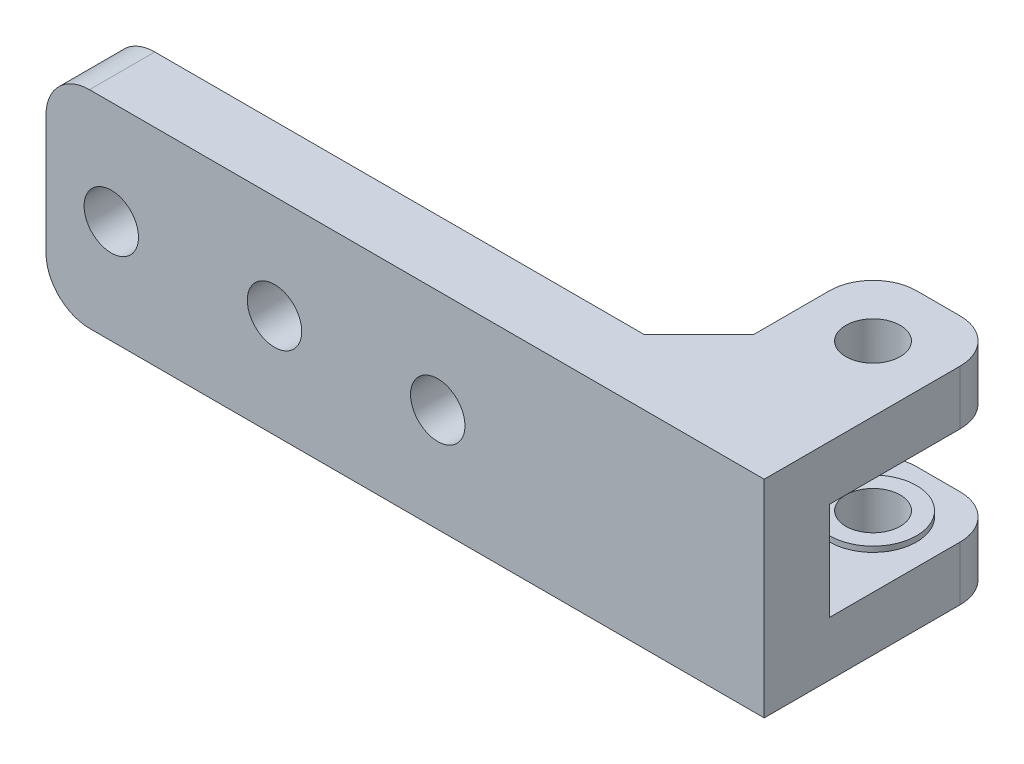
ISO-10303-21;
HEADER;
FILE_DESCRIPTION(('STEP AP214'),'2;1');
FILE_NAME('part.step','',(''),(''),'','','');
FILE_SCHEMA(('AUTOMOTIVE_DESIGN { 1 0 10303 214 1 1 1 1 }'));
ENDSEC;
DATA;
#1=APPLICATION_CONTEXT('core data for automotive mechanical design processes');
#2=APPLICATION_PROTOCOL_DEFINITION('international standard','automotive_design',2000,#1);
#3=PRODUCT_CONTEXT('',#1,'mechanical');
#4=PRODUCT('Part','Part','',(#3));
#5=PRODUCT_RELATED_PRODUCT_CATEGORY('part','',(#4));
#6=PRODUCT_DEFINITION_FORMATION('','',#4);
#7=PRODUCT_DEFINITION_CONTEXT('part definition',#1,'design');
#8=PRODUCT_DEFINITION('design','',#6,#7);
#9=PRODUCT_DEFINITION_SHAPE('','',#8);
#10=(LENGTH_UNIT() NAMED_UNIT(*) SI_UNIT(.MILLI.,.METRE.));
#11=(NAMED_UNIT(*) PLANE_ANGLE_UNIT() SI_UNIT($,.RADIAN.));
#12=(NAMED_UNIT(*) SI_UNIT($,.STERADIAN.) SOLID_ANGLE_UNIT());
#13=UNCERTAINTY_MEASURE_WITH_UNIT(LENGTH_MEASURE(1.E-05),#10,'distance_accuracy_value','');
#14=(GEOMETRIC_REPRESENTATION_CONTEXT(3) GLOBAL_UNCERTAINTY_ASSIGNED_CONTEXT((#13)) GLOBAL_UNIT_ASSIGNED_CONTEXT((#10,
#11,#12)) REPRESENTATION_CONTEXT('',''));
#15=CARTESIAN_POINT('',(0.,0.,0.));
#16=DIRECTION('',(0.,0.,1.));
#17=DIRECTION('',(1.,0.,0.));
#18=AXIS2_PLACEMENT_3D('',#15,#16,#17);
#19=CARTESIAN_POINT('',(0.,0.,0.));
#20=DIRECTION('',(1.,0.,0.));
#21=DIRECTION('',(0.,0.,-1.));
#22=AXIS2_PLACEMENT_3D('',#19,#20,#21);
#23=PLANE('',#22);
#24=DIRECTION('',(0.,0.,-1.));
#25=VECTOR('',#24,1.);
#26=CARTESIAN_POINT('',(0.,0.,0.));
#27=LINE('',#26,#25);
#28=CARTESIAN_POINT('',(0.,0.,-11.));
#29=VERTEX_POINT('',#28);
#30=CARTESIAN_POINT('',(0.,0.,-18.));
#31=VERTEX_POINT('',#30);
#32=EDGE_CURVE('E360',#29,#31,#27,.T.);
#33=ORIENTED_EDGE('',*,*,#32,.F.);
#34=DIRECTION('',(0.,1.,0.));
#35=VECTOR('',#34,1.);
#36=CARTESIAN_POINT('',(0.,5.,-11.));
#37=LINE('',#36,#35);
#38=CARTESIAN_POINT('',(0.,5.,-11.));
#39=VERTEX_POINT('',#38);
#40=EDGE_CURVE('E238',#29,#39,#37,.T.);
#41=ORIENTED_EDGE('',*,*,#40,.T.);
#42=DIRECTION('',(0.,0.,1.));
#43=VECTOR('',#42,1.);
#44=CARTESIAN_POINT('',(0.,5.,-22.));
#45=LINE('',#44,#43);
#46=CARTESIAN_POINT('',(0.,5.,-18.));
#47=VERTEX_POINT('',#46);
#48=EDGE_CURVE('E326',#47,#39,#45,.T.);
#49=ORIENTED_EDGE('',*,*,#48,.F.);
#50=DIRECTION('',(0.,1.,0.));
#51=VECTOR('',#50,1.);
#52=CARTESIAN_POINT('',(0.,0.,-18.));
#53=LINE('',#52,#51);
#54=EDGE_CURVE('E212',#47,#31,#53,.F.);
#55=ORIENTED_EDGE('',*,*,#54,.T.);
#56=EDGE_LOOP('',(#33,#41,#49,#55));
#57=FACE_BOUND('',#56,.T.);
#58=ADVANCED_FACE('F37',(#57),#23,.F.);
#59=CARTESIAN_POINT('',(12.,5.,-22.));
#60=DIRECTION('',(0.,-1.,0.));
#61=DIRECTION('',(0.,0.,-1.));
#62=AXIS2_PLACEMENT_3D('',#59,#60,#61);
#63=PLANE('',#62);
#64=DIRECTION('',(-1.,0.,0.));
#65=VECTOR('',#64,1.);
#66=CARTESIAN_POINT('',(12.,5.,-22.));
#67=LINE('',#66,#65);
#68=CARTESIAN_POINT('',(8.,5.,-22.));
#69=VERTEX_POINT('',#68);
#70=CARTESIAN_POINT('',(4.,5.,-22.));
#71=VERTEX_POINT('',#70);
#72=EDGE_CURVE('E197',#69,#71,#67,.T.);
#73=ORIENTED_EDGE('',*,*,#72,.T.);
#74=CARTESIAN_POINT('',(4.,5.,-18.));
#75=DIRECTION('',(0.,-1.,0.));
#76=DIRECTION('',(0.,0.,-1.));
#77=AXIS2_PLACEMENT_3D('',#74,#75,#76);
#78=CIRCLE('',#77,4.);
#79=EDGE_CURVE('E229',#71,#47,#78,.F.);
#80=ORIENTED_EDGE('',*,*,#79,.T.);
#81=ORIENTED_EDGE('',*,*,#48,.T.);
#82=DIRECTION('',(0.707106781186544,0.,-0.707106781186551));
#83=VECTOR('',#82,1.);
#84=CARTESIAN_POINT('',(11.4999999999999,5.,-22.5000000000001));
#85=LINE('',#84,#83);
#86=CARTESIAN_POINT('',(-4.99999999999998,5.,-6.));
#87=VERTEX_POINT('',#86);
#88=EDGE_CURVE('E250',#39,#87,#85,.F.);
#89=ORIENTED_EDGE('',*,*,#88,.T.);
#90=DIRECTION('',(-1.,0.,0.));
#91=VECTOR('',#90,1.);
#92=CARTESIAN_POINT('',(12.,5.,-6.));
#93=LINE('',#92,#91);
#94=CARTESIAN_POINT('',(12.,5.,-6.));
#95=VERTEX_POINT('',#94);
#96=EDGE_CURVE('E384',#95,#87,#93,.T.);
#97=ORIENTED_EDGE('',*,*,#96,.F.);
#98=DIRECTION('',(0.,0.,1.));
#99=VECTOR('',#98,1.);
#100=CARTESIAN_POINT('',(12.,5.,-22.));
#101=LINE('',#100,#99);
#102=CARTESIAN_POINT('',(12.,5.,-18.));
#103=VERTEX_POINT('',#102);
#104=EDGE_CURVE('E174',#103,#95,#101,.T.);
#105=ORIENTED_EDGE('',*,*,#104,.F.);
#106=CARTESIAN_POINT('',(8.,5.,-18.));
#107=DIRECTION('',(0.,-1.,0.));
#108=DIRECTION('',(0.,0.,-1.));
#109=AXIS2_PLACEMENT_3D('',#106,#107,#108);
#110=CIRCLE('',#109,4.);
#111=EDGE_CURVE('E227',#103,#69,#110,.F.);
#112=ORIENTED_EDGE('',*,*,#111,.T.);
#113=EDGE_LOOP('',(#73,#80,#81,#89,#97,#105,#112));
#114=FACE_BOUND('',#113,.T.);
#115=CARTESIAN_POINT('',(6.,5.,-16.));
#116=DIRECTION('',(0.,-1.,0.));
#117=DIRECTION('',(0.,0.,-1.));
#118=AXIS2_PLACEMENT_3D('',#115,#116,#117);
#119=CIRCLE('',#118,4.);
#120=CARTESIAN_POINT('',(6.,5.,-20.));
#121=VERTEX_POINT('',#120);
#122=EDGE_CURVE('E194',#121,#121,#119,.F.);
#123=ORIENTED_EDGE('',*,*,#122,.F.);
#124=EDGE_LOOP('',(#123));
#125=FACE_BOUND('',#124,.T.);
#126=ADVANCED_FACE('F294',(#114,#125),#63,.F.);
#127=CARTESIAN_POINT('',(12.,14.,-6.));
#128=DIRECTION('',(0.,1.,0.));
#129=DIRECTION('',(0.,0.,1.));
#130=AXIS2_PLACEMENT_3D('',#127,#128,#129);
#131=PLANE('',#130);
#132=DIRECTION('',(-1.,0.,0.));
#133=VECTOR('',#132,1.);
#134=CARTESIAN_POINT('',(12.,14.,-6.));
#135=LINE('',#134,#133);
#136=CARTESIAN_POINT('',(12.,14.,-6.));
#137=VERTEX_POINT('',#136);
#138=CARTESIAN_POINT('',(-4.99999999999998,14.,-6.));
#139=VERTEX_POINT('',#138);
#140=EDGE_CURVE('E382',#137,#139,#135,.T.);
#141=ORIENTED_EDGE('',*,*,#140,.T.);
#142=DIRECTION('',(-0.707106781186544,0.,0.707106781186551));
#143=VECTOR('',#142,1.);
#144=CARTESIAN_POINT('',(3.49999999999992,14.,-14.5));
#145=LINE('',#144,#143);
#146=CARTESIAN_POINT('',(0.,14.,-11.));
#147=VERTEX_POINT('',#146);
#148=EDGE_CURVE('E257',#139,#147,#145,.F.);
#149=ORIENTED_EDGE('',*,*,#148,.T.);
#150=DIRECTION('',(0.,0.,-1.));
#151=VECTOR('',#150,1.);
#152=CARTESIAN_POINT('',(0.,14.,-6.));
#153=LINE('',#152,#151);
#154=CARTESIAN_POINT('',(0.,14.,-18.));
#155=VERTEX_POINT('',#154);
#156=EDGE_CURVE('E319',#147,#155,#153,.T.);
#157=ORIENTED_EDGE('',*,*,#156,.T.);
#158=CARTESIAN_POINT('',(4.,14.,-18.));
#159=DIRECTION('',(0.,1.,0.));
#160=DIRECTION('',(0.,0.,1.));
#161=AXIS2_PLACEMENT_3D('',#158,#159,#160);
#162=CIRCLE('',#161,4.);
#163=CARTESIAN_POINT('',(4.,14.,-22.));
#164=VERTEX_POINT('',#163);
#165=EDGE_CURVE('E220',#155,#164,#162,.F.);
#166=ORIENTED_EDGE('',*,*,#165,.T.);
#167=DIRECTION('',(-1.,0.,0.));
#168=VECTOR('',#167,1.);
#169=CARTESIAN_POINT('',(12.,14.,-22.));
#170=LINE('',#169,#168);
#171=CARTESIAN_POINT('',(8.,14.,-22.));
#172=VERTEX_POINT('',#171);
#173=EDGE_CURVE('E379',#172,#164,#170,.T.);
#174=ORIENTED_EDGE('',*,*,#173,.F.);
#175=CARTESIAN_POINT('',(8.,14.,-18.));
#176=DIRECTION('',(0.,1.,0.));
#177=DIRECTION('',(0.,0.,1.));
#178=AXIS2_PLACEMENT_3D('',#175,#176,#177);
#179=CIRCLE('',#178,4.);
#180=CARTESIAN_POINT('',(12.,14.,-18.));
#181=VERTEX_POINT('',#180);
#182=EDGE_CURVE('E218',#172,#181,#179,.F.);
#183=ORIENTED_EDGE('',*,*,#182,.T.);
#184=DIRECTION('',(0.,0.,-1.));
#185=VECTOR('',#184,1.);
#186=CARTESIAN_POINT('',(12.,14.,-6.));
#187=LINE('',#186,#185);
#188=EDGE_CURVE('E366',#137,#181,#187,.T.);
#189=ORIENTED_EDGE('',*,*,#188,.F.);
#190=EDGE_LOOP('',(#141,#149,#157,#166,#174,#183,#189));
#191=FACE_BOUND('',#190,.T.);
#192=CARTESIAN_POINT('',(6.,14.,-16.));
#193=DIRECTION('',(0.,1.,0.));
#194=DIRECTION('',(0.,0.,1.));
#195=AXIS2_PLACEMENT_3D('',#192,#193,#194);
#196=CIRCLE('',#195,4.);
#197=CARTESIAN_POINT('',(6.,14.,-12.));
#198=VERTEX_POINT('',#197);
#199=EDGE_CURVE('E190',#198,#198,#196,.F.);
#200=ORIENTED_EDGE('',*,*,#199,.F.);
#201=EDGE_LOOP('',(#200));
#202=FACE_BOUND('',#201,.T.);
#203=ADVANCED_FACE('F301',(#191,#202),#131,.F.);
#204=CARTESIAN_POINT('',(12.,19.,0.));
#205=DIRECTION('',(0.,0.,-1.));
#206=DIRECTION('',(-1.,0.,0.));
#207=AXIS2_PLACEMENT_3D('',#204,#205,#206);
#208=PLANE('',#207);
#209=CARTESIAN_POINT('',(-33.,9.49999999999999,0.));
#210=DIRECTION('',(0.,0.,-1.));
#211=DIRECTION('',(-1.,0.,0.));
#212=AXIS2_PLACEMENT_3D('',#209,#210,#211);
#213=CIRCLE('',#212,2.5);
#214=CARTESIAN_POINT('',(-35.5,9.49999999999999,0.));
#215=VERTEX_POINT('',#214);
#216=EDGE_CURVE('E675',#215,#215,#213,.T.);
#217=ORIENTED_EDGE('',*,*,#216,.T.);
#218=EDGE_LOOP('',(#217));
#219=FACE_BOUND('',#218,.T.);
#220=CARTESIAN_POINT('',(-18.,9.49999999999999,0.));
#221=DIRECTION('',(0.,0.,-1.));
#222=DIRECTION('',(-1.,0.,0.));
#223=AXIS2_PLACEMENT_3D('',#220,#221,#222);
#224=CIRCLE('',#223,2.5);
#225=CARTESIAN_POINT('',(-20.5,9.49999999999999,0.));
#226=VERTEX_POINT('',#225);
#227=EDGE_CURVE('E680',#226,#226,#224,.T.);
#228=ORIENTED_EDGE('',*,*,#227,.T.);
#229=EDGE_LOOP('',(#228));
#230=FACE_BOUND('',#229,.T.);
#231=CARTESIAN_POINT('',(-48.,9.49999999999999,0.));
#232=DIRECTION('',(0.,0.,-1.));
#233=DIRECTION('',(-1.,0.,0.));
#234=AXIS2_PLACEMENT_3D('',#231,#232,#233);
#235=CIRCLE('',#234,2.5);
#236=CARTESIAN_POINT('',(-50.5,9.49999999999999,0.));
#237=VERTEX_POINT('',#236);
#238=EDGE_CURVE('E337',#237,#237,#235,.T.);
#239=ORIENTED_EDGE('',*,*,#238,.T.);
#240=EDGE_LOOP('',(#239));
#241=FACE_BOUND('',#240,.T.);
#242=DIRECTION('',(0.,-1.,0.));
#243=VECTOR('',#242,1.);
#244=CARTESIAN_POINT('',(-54.,19.,0.));
#245=LINE('',#244,#243);
#246=CARTESIAN_POINT('',(-54.,15.,0.));
#247=VERTEX_POINT('',#246);
#248=CARTESIAN_POINT('',(-54.,4.,0.));
#249=VERTEX_POINT('',#248);
#250=EDGE_CURVE('E335',#247,#249,#245,.T.);
#251=ORIENTED_EDGE('',*,*,#250,.T.);
#252=CARTESIAN_POINT('',(-50.,4.,0.));
#253=DIRECTION('',(0.,0.,-1.));
#254=DIRECTION('',(-1.,0.,0.));
#255=AXIS2_PLACEMENT_3D('',#252,#253,#254);
#256=CIRCLE('',#255,4.);
#257=CARTESIAN_POINT('',(-50.,0.,0.));
#258=VERTEX_POINT('',#257);
#259=EDGE_CURVE('E189',#249,#258,#256,.F.);
#260=ORIENTED_EDGE('',*,*,#259,.T.);
#261=DIRECTION('',(-1.,0.,0.));
#262=VECTOR('',#261,1.);
#263=CARTESIAN_POINT('',(12.,0.,0.));
#264=LINE('',#263,#262);
#265=CARTESIAN_POINT('',(12.,0.,0.));
#266=VERTEX_POINT('',#265);
#267=EDGE_CURVE('E167',#266,#258,#264,.T.);
#268=ORIENTED_EDGE('',*,*,#267,.F.);
#269=DIRECTION('',(0.,-1.,0.));
#270=VECTOR('',#269,1.);
#271=CARTESIAN_POINT('',(12.,19.,0.));
#272=LINE('',#271,#270);
#273=CARTESIAN_POINT('',(12.,19.,0.));
#274=VERTEX_POINT('',#273);
#275=EDGE_CURVE('E175',#274,#266,#272,.T.);
#276=ORIENTED_EDGE('',*,*,#275,.F.);
#277=DIRECTION('',(-1.,0.,0.));
#278=VECTOR('',#277,1.);
#279=CARTESIAN_POINT('',(12.,19.,0.));
#280=LINE('',#279,#278);
#281=CARTESIAN_POINT('',(-50.,19.,0.));
#282=VERTEX_POINT('',#281);
#283=EDGE_CURVE('E370',#274,#282,#280,.T.);
#284=ORIENTED_EDGE('',*,*,#283,.T.);
#285=CARTESIAN_POINT('',(-50.,15.,0.));
#286=DIRECTION('',(0.,0.,-1.));
#287=DIRECTION('',(-1.,0.,0.));
#288=AXIS2_PLACEMENT_3D('',#285,#286,#287);
#289=CIRCLE('',#288,4.);
#290=EDGE_CURVE('E264',#282,#247,#289,.F.);
#291=ORIENTED_EDGE('',*,*,#290,.T.);
#292=EDGE_LOOP('',(#251,#260,#268,#276,#284,#291));
#293=FACE_BOUND('',#292,.T.);
#294=ADVANCED_FACE('F188',(#219,#230,#241,#293),#208,.F.);
#295=CARTESIAN_POINT('',(12.,0.,0.));
#296=DIRECTION('',(0.,1.,0.));
#297=DIRECTION('',(0.,0.,1.));
#298=AXIS2_PLACEMENT_3D('',#295,#296,#297);
#299=PLANE('',#298);
#300=CARTESIAN_POINT('',(6.,0.,-16.));
#301=DIRECTION('',(0.,1.,0.));
#302=DIRECTION('',(0.,0.,1.));
#303=AXIS2_PLACEMENT_3D('',#300,#301,#302);
#304=CIRCLE('',#303,2.5);
#305=CARTESIAN_POINT('',(6.,0.,-13.5));
#306=VERTEX_POINT('',#305);
#307=EDGE_CURVE('E357',#306,#306,#304,.T.);
#308=ORIENTED_EDGE('',*,*,#307,.T.);
#309=EDGE_LOOP('',(#308));
#310=FACE_BOUND('',#309,.T.);
#311=ORIENTED_EDGE('',*,*,#267,.T.);
#312=DIRECTION('',(0.,0.,1.));
#313=VECTOR('',#312,1.);
#314=CARTESIAN_POINT('',(-50.,0.,-6.));
#315=LINE('',#314,#313);
#316=CARTESIAN_POINT('',(-50.,0.,-6.));
#317=VERTEX_POINT('',#316);
#318=EDGE_CURVE('E60',#258,#317,#315,.F.);
#319=ORIENTED_EDGE('',*,*,#318,.T.);
#320=DIRECTION('',(1.,0.,0.));
#321=VECTOR('',#320,1.);
#322=CARTESIAN_POINT('',(0.,0.,-6.));
#323=LINE('',#322,#321);
#324=CARTESIAN_POINT('',(-4.99999999999998,0.,-6.));
#325=VERTEX_POINT('',#324);
#326=EDGE_CURVE('E272',#317,#325,#323,.T.);
#327=ORIENTED_EDGE('',*,*,#326,.T.);
#328=DIRECTION('',(-0.707106781186544,0.,0.707106781186551));
#329=VECTOR('',#328,1.);
#330=CARTESIAN_POINT('',(0.499999999999915,0.,-11.5));
#331=LINE('',#330,#329);
#332=EDGE_CURVE('E253',#325,#29,#331,.F.);
#333=ORIENTED_EDGE('',*,*,#332,.T.);
#334=ORIENTED_EDGE('',*,*,#32,.T.);
#335=CARTESIAN_POINT('',(4.,0.,-18.));
#336=DIRECTION('',(0.,1.,0.));
#337=DIRECTION('',(0.,0.,1.));
#338=AXIS2_PLACEMENT_3D('',#335,#336,#337);
#339=CIRCLE('',#338,4.);
#340=CARTESIAN_POINT('',(4.,0.,-22.));
#341=VERTEX_POINT('',#340);
#342=EDGE_CURVE('E232',#31,#341,#339,.F.);
#343=ORIENTED_EDGE('',*,*,#342,.T.);
#344=DIRECTION('',(-1.,0.,0.));
#345=VECTOR('',#344,1.);
#346=CARTESIAN_POINT('',(12.,0.,-22.));
#347=LINE('',#346,#345);
#348=CARTESIAN_POINT('',(8.,0.,-22.));
#349=VERTEX_POINT('',#348);
#350=EDGE_CURVE('E191',#349,#341,#347,.T.);
#351=ORIENTED_EDGE('',*,*,#350,.F.);
#352=CARTESIAN_POINT('',(8.,0.,-18.));
#353=DIRECTION('',(0.,1.,0.));
#354=DIRECTION('',(0.,0.,1.));
#355=AXIS2_PLACEMENT_3D('',#352,#353,#354);
#356=CIRCLE('',#355,4.);
#357=CARTESIAN_POINT('',(12.,0.,-18.));
#358=VERTEX_POINT('',#357);
#359=EDGE_CURVE('E170',#349,#358,#356,.F.);
#360=ORIENTED_EDGE('',*,*,#359,.T.);
#361=DIRECTION('',(0.,0.,-1.));
#362=VECTOR('',#361,1.);
#363=CARTESIAN_POINT('',(12.,0.,0.));
#364=LINE('',#363,#362);
#365=EDGE_CURVE('E163',#266,#358,#364,.T.);
#366=ORIENTED_EDGE('',*,*,#365,.F.);
#367=EDGE_LOOP('',(#311,#319,#327,#333,#334,#343,#351,#360,#366));
#368=FACE_BOUND('',#367,.T.);
#369=ADVANCED_FACE('F165',(#310,#368),#299,.F.);
#370=CARTESIAN_POINT('',(12.,0.,-22.));
#371=DIRECTION('',(0.,0.,1.));
#372=DIRECTION('',(1.,0.,0.));
#373=AXIS2_PLACEMENT_3D('',#370,#371,#372);
#374=PLANE('',#373);
#375=ORIENTED_EDGE('',*,*,#350,.T.);
#376=DIRECTION('',(0.,1.,0.));
#377=VECTOR('',#376,1.);
#378=CARTESIAN_POINT('',(4.,0.,-22.));
#379=LINE('',#378,#377);
#380=EDGE_CURVE('E224',#341,#71,#379,.T.);
#381=ORIENTED_EDGE('',*,*,#380,.T.);
#382=ORIENTED_EDGE('',*,*,#72,.F.);
#383=DIRECTION('',(0.,1.,0.));
#384=VECTOR('',#383,1.);
#385=CARTESIAN_POINT('',(8.,0.,-22.));
#386=LINE('',#385,#384);
#387=EDGE_CURVE('E222',#69,#349,#386,.F.);
#388=ORIENTED_EDGE('',*,*,#387,.T.);
#389=EDGE_LOOP('',(#375,#381,#382,#388));
#390=FACE_BOUND('',#389,.T.);
#391=ADVANCED_FACE('F392',(#390),#374,.F.);
#392=CARTESIAN_POINT('',(12.,5.,-6.));
#393=DIRECTION('',(0.,0.,1.));
#394=DIRECTION('',(1.,0.,0.));
#395=AXIS2_PLACEMENT_3D('',#392,#393,#394);
#396=PLANE('',#395);
#397=CARTESIAN_POINT('',(-33.,9.49999999999999,-6.));
#398=DIRECTION('',(0.,0.,-1.));
#399=DIRECTION('',(-1.,0.,0.));
#400=AXIS2_PLACEMENT_3D('',#397,#398,#399);
#401=CIRCLE('',#400,2.5);
#402=CARTESIAN_POINT('',(-35.5,9.49999999999999,-6.));
#403=VERTEX_POINT('',#402);
#404=EDGE_CURVE('E668',#403,#403,#401,.T.);
#405=ORIENTED_EDGE('',*,*,#404,.F.);
#406=EDGE_LOOP('',(#405));
#407=FACE_BOUND('',#406,.T.);
#408=CARTESIAN_POINT('',(-18.,9.49999999999999,-6.));
#409=DIRECTION('',(0.,0.,-1.));
#410=DIRECTION('',(-1.,0.,0.));
#411=AXIS2_PLACEMENT_3D('',#408,#409,#410);
#412=CIRCLE('',#411,2.5);
#413=CARTESIAN_POINT('',(-20.5,9.49999999999999,-6.));
#414=VERTEX_POINT('',#413);
#415=EDGE_CURVE('E672',#414,#414,#412,.T.);
#416=ORIENTED_EDGE('',*,*,#415,.F.);
#417=EDGE_LOOP('',(#416));
#418=FACE_BOUND('',#417,.T.);
#419=CARTESIAN_POINT('',(-48.,9.49999999999999,-6.));
#420=DIRECTION('',(0.,0.,-1.));
#421=DIRECTION('',(-1.,0.,0.));
#422=AXIS2_PLACEMENT_3D('',#419,#420,#421);
#423=CIRCLE('',#422,2.5);
#424=CARTESIAN_POINT('',(-50.5,9.49999999999999,-6.));
#425=VERTEX_POINT('',#424);
#426=EDGE_CURVE('E340',#425,#425,#423,.T.);
#427=ORIENTED_EDGE('',*,*,#426,.F.);
#428=EDGE_LOOP('',(#427));
#429=FACE_BOUND('',#428,.T.);
#430=ORIENTED_EDGE('',*,*,#326,.F.);
#431=CARTESIAN_POINT('',(-50.,4.,-6.));
#432=DIRECTION('',(0.,0.,1.));
#433=DIRECTION('',(1.,0.,0.));
#434=AXIS2_PLACEMENT_3D('',#431,#432,#433);
#435=CIRCLE('',#434,4.);
#436=CARTESIAN_POINT('',(-54.,4.,-6.));
#437=VERTEX_POINT('',#436);
#438=EDGE_CURVE('E45',#317,#437,#435,.F.);
#439=ORIENTED_EDGE('',*,*,#438,.T.);
#440=DIRECTION('',(0.,-1.,0.));
#441=VECTOR('',#440,1.);
#442=CARTESIAN_POINT('',(-54.,19.,-6.));
#443=LINE('',#442,#441);
#444=CARTESIAN_POINT('',(-54.,15.,-6.));
#445=VERTEX_POINT('',#444);
#446=EDGE_CURVE('E271',#445,#437,#443,.T.);
#447=ORIENTED_EDGE('',*,*,#446,.F.);
#448=CARTESIAN_POINT('',(-50.,15.,-6.));
#449=DIRECTION('',(0.,0.,1.));
#450=DIRECTION('',(1.,0.,0.));
#451=AXIS2_PLACEMENT_3D('',#448,#449,#450);
#452=CIRCLE('',#451,4.);
#453=CARTESIAN_POINT('',(-50.,19.,-6.));
#454=VERTEX_POINT('',#453);
#455=EDGE_CURVE('E52',#445,#454,#452,.F.);
#456=ORIENTED_EDGE('',*,*,#455,.T.);
#457=DIRECTION('',(-1.,0.,0.));
#458=VECTOR('',#457,1.);
#459=CARTESIAN_POINT('',(0.,19.,-6.));
#460=LINE('',#459,#458);
#461=CARTESIAN_POINT('',(-4.99999999999998,19.,-6.));
#462=VERTEX_POINT('',#461);
#463=EDGE_CURVE('E279',#462,#454,#460,.T.);
#464=ORIENTED_EDGE('',*,*,#463,.F.);
#465=DIRECTION('',(0.,-1.,0.));
#466=VECTOR('',#465,1.);
#467=CARTESIAN_POINT('',(-4.99999999999998,14.,-6.));
#468=LINE('',#467,#466);
#469=EDGE_CURVE('E241',#462,#139,#468,.T.);
#470=ORIENTED_EDGE('',*,*,#469,.T.);
#471=ORIENTED_EDGE('',*,*,#140,.F.);
#472=DIRECTION('',(0.,1.,0.));
#473=VECTOR('',#472,1.);
#474=CARTESIAN_POINT('',(12.,5.,-6.));
#475=LINE('',#474,#473);
#476=EDGE_CURVE('E364',#95,#137,#475,.T.);
#477=ORIENTED_EDGE('',*,*,#476,.F.);
#478=ORIENTED_EDGE('',*,*,#96,.T.);
#479=DIRECTION('',(0.,-1.,0.));
#480=VECTOR('',#479,1.);
#481=CARTESIAN_POINT('',(-4.99999999999998,0.,-6.));
#482=LINE('',#481,#480);
#483=EDGE_CURVE('E244',#87,#325,#482,.T.);
#484=ORIENTED_EDGE('',*,*,#483,.T.);
#485=EDGE_LOOP('',(#430,#439,#447,#456,#464,#470,#471,#477,#478,#484));
#486=FACE_BOUND('',#485,.T.);
#487=ADVANCED_FACE('F270',(#407,#418,#429,#486),#396,.F.);
#488=CARTESIAN_POINT('',(12.,14.,-22.));
#489=DIRECTION('',(0.,0.,1.));
#490=DIRECTION('',(1.,0.,0.));
#491=AXIS2_PLACEMENT_3D('',#488,#489,#490);
#492=PLANE('',#491);
#493=ORIENTED_EDGE('',*,*,#173,.T.);
#494=DIRECTION('',(0.,1.,0.));
#495=VECTOR('',#494,1.);
#496=CARTESIAN_POINT('',(4.,14.,-22.));
#497=LINE('',#496,#495);
#498=CARTESIAN_POINT('',(4.,19.,-22.));
#499=VERTEX_POINT('',#498);
#500=EDGE_CURVE('E205',#164,#499,#497,.T.);
#501=ORIENTED_EDGE('',*,*,#500,.T.);
#502=DIRECTION('',(-1.,0.,0.));
#503=VECTOR('',#502,1.);
#504=CARTESIAN_POINT('',(12.,19.,-22.));
#505=LINE('',#504,#503);
#506=CARTESIAN_POINT('',(8.,19.,-22.));
#507=VERTEX_POINT('',#506);
#508=EDGE_CURVE('E376',#507,#499,#505,.T.);
#509=ORIENTED_EDGE('',*,*,#508,.F.);
#510=DIRECTION('',(0.,1.,0.));
#511=VECTOR('',#510,1.);
#512=CARTESIAN_POINT('',(8.,14.,-22.));
#513=LINE('',#512,#511);
#514=EDGE_CURVE('E203',#507,#172,#513,.F.);
#515=ORIENTED_EDGE('',*,*,#514,.T.);
#516=EDGE_LOOP('',(#493,#501,#509,#515));
#517=FACE_BOUND('',#516,.T.);
#518=ADVANCED_FACE('F407',(#517),#492,.F.);
#519=CARTESIAN_POINT('',(12.,19.,-22.));
#520=DIRECTION('',(0.,-1.,0.));
#521=DIRECTION('',(0.,0.,-1.));
#522=AXIS2_PLACEMENT_3D('',#519,#520,#521);
#523=PLANE('',#522);
#524=CARTESIAN_POINT('',(6.,19.,-16.));
#525=DIRECTION('',(0.,1.,0.));
#526=DIRECTION('',(0.,0.,1.));
#527=AXIS2_PLACEMENT_3D('',#524,#525,#526);
#528=CIRCLE('',#527,2.5);
#529=CARTESIAN_POINT('',(6.,19.,-13.5));
#530=VERTEX_POINT('',#529);
#531=EDGE_CURVE('E356',#530,#530,#528,.T.);
#532=ORIENTED_EDGE('',*,*,#531,.F.);
#533=EDGE_LOOP('',(#532));
#534=FACE_BOUND('',#533,.T.);
#535=ORIENTED_EDGE('',*,*,#463,.T.);
#536=DIRECTION('',(0.,0.,1.));
#537=VECTOR('',#536,1.);
#538=CARTESIAN_POINT('',(-50.,19.,0.));
#539=LINE('',#538,#537);
#540=EDGE_CURVE('E11',#454,#282,#539,.T.);
#541=ORIENTED_EDGE('',*,*,#540,.T.);
#542=ORIENTED_EDGE('',*,*,#283,.F.);
#543=DIRECTION('',(0.,0.,1.));
#544=VECTOR('',#543,1.);
#545=CARTESIAN_POINT('',(12.,19.,-22.));
#546=LINE('',#545,#544);
#547=CARTESIAN_POINT('',(12.,19.,-18.));
#548=VERTEX_POINT('',#547);
#549=EDGE_CURVE('E181',#548,#274,#546,.T.);
#550=ORIENTED_EDGE('',*,*,#549,.F.);
#551=CARTESIAN_POINT('',(8.,19.,-18.));
#552=DIRECTION('',(0.,-1.,0.));
#553=DIRECTION('',(0.,0.,-1.));
#554=AXIS2_PLACEMENT_3D('',#551,#552,#553);
#555=CIRCLE('',#554,4.);
#556=EDGE_CURVE('E208',#548,#507,#555,.F.);
#557=ORIENTED_EDGE('',*,*,#556,.T.);
#558=ORIENTED_EDGE('',*,*,#508,.T.);
#559=CARTESIAN_POINT('',(4.,19.,-18.));
#560=DIRECTION('',(0.,-1.,0.));
#561=DIRECTION('',(0.,0.,-1.));
#562=AXIS2_PLACEMENT_3D('',#559,#560,#561);
#563=CIRCLE('',#562,4.);
#564=CARTESIAN_POINT('',(0.,19.,-18.));
#565=VERTEX_POINT('',#564);
#566=EDGE_CURVE('E210',#499,#565,#563,.F.);
#567=ORIENTED_EDGE('',*,*,#566,.T.);
#568=DIRECTION('',(0.,0.,1.));
#569=VECTOR('',#568,1.);
#570=CARTESIAN_POINT('',(0.,19.,-22.));
#571=LINE('',#570,#569);
#572=CARTESIAN_POINT('',(0.,19.,-11.));
#573=VERTEX_POINT('',#572);
#574=EDGE_CURVE('E185',#565,#573,#571,.T.);
#575=ORIENTED_EDGE('',*,*,#574,.T.);
#576=DIRECTION('',(0.707106781186544,0.,-0.707106781186551));
#577=VECTOR('',#576,1.);
#578=CARTESIAN_POINT('',(11.4999999999999,19.,-22.5000000000001));
#579=LINE('',#578,#577);
#580=EDGE_CURVE('E255',#573,#462,#579,.F.);
#581=ORIENTED_EDGE('',*,*,#580,.T.);
#582=EDGE_LOOP('',(#535,#541,#542,#550,#557,#558,#567,#575,#581));
#583=FACE_BOUND('',#582,.T.);
#584=ADVANCED_FACE('F317',(#534,#583),#523,.F.);
#585=CARTESIAN_POINT('',(12.,0.,0.));
#586=DIRECTION('',(1.,0.,0.));
#587=DIRECTION('',(0.,0.,-1.));
#588=AXIS2_PLACEMENT_3D('',#585,#586,#587);
#589=PLANE('',#588);
#590=ORIENTED_EDGE('',*,*,#365,.T.);
#591=DIRECTION('',(0.,1.,0.));
#592=VECTOR('',#591,1.);
#593=CARTESIAN_POINT('',(12.,5.,-18.));
#594=LINE('',#593,#592);
#595=EDGE_CURVE('E236',#358,#103,#594,.T.);
#596=ORIENTED_EDGE('',*,*,#595,.T.);
#597=ORIENTED_EDGE('',*,*,#104,.T.);
#598=ORIENTED_EDGE('',*,*,#476,.T.);
#599=ORIENTED_EDGE('',*,*,#188,.T.);
#600=DIRECTION('',(0.,1.,0.));
#601=VECTOR('',#600,1.);
#602=CARTESIAN_POINT('',(12.,19.,-18.));
#603=LINE('',#602,#601);
#604=EDGE_CURVE('E234',#181,#548,#603,.T.);
#605=ORIENTED_EDGE('',*,*,#604,.T.);
#606=ORIENTED_EDGE('',*,*,#549,.T.);
#607=ORIENTED_EDGE('',*,*,#275,.T.);
#608=EDGE_LOOP('',(#590,#596,#597,#598,#599,#605,#606,#607));
#609=FACE_BOUND('',#608,.T.);
#610=ADVANCED_FACE('F178',(#609),#589,.T.);
#611=ORIENTED_EDGE('',*,*,#156,.F.);
#612=DIRECTION('',(0.,1.,0.));
#613=VECTOR('',#612,1.);
#614=CARTESIAN_POINT('',(0.,19.,-11.));
#615=LINE('',#614,#613);
#616=EDGE_CURVE('E247',#147,#573,#615,.T.);
#617=ORIENTED_EDGE('',*,*,#616,.T.);
#618=ORIENTED_EDGE('',*,*,#574,.F.);
#619=DIRECTION('',(0.,1.,0.));
#620=VECTOR('',#619,1.);
#621=CARTESIAN_POINT('',(0.,0.,-18.));
#622=LINE('',#621,#620);
#623=EDGE_CURVE('E215',#565,#155,#622,.F.);
#624=ORIENTED_EDGE('',*,*,#623,.T.);
#625=EDGE_LOOP('',(#611,#617,#618,#624));
#626=FACE_BOUND('',#625,.T.);
#627=ADVANCED_FACE('F297',(#626),#23,.F.);
#628=CARTESIAN_POINT('',(6.,0.,-16.));
#629=DIRECTION('',(0.,1.,0.));
#630=DIRECTION('',(0.,0.,1.));
#631=AXIS2_PLACEMENT_3D('',#628,#629,#630);
#632=CYLINDRICAL_SURFACE('',#631,2.5);
#633=ORIENTED_EDGE('',*,*,#531,.T.);
#634=EDGE_LOOP('',(#633));
#635=FACE_BOUND('',#634,.T.);
#636=CARTESIAN_POINT('',(6.,13.5,-16.));
#637=DIRECTION('',(0.,-1.,0.));
#638=DIRECTION('',(0.,0.,-1.));
#639=AXIS2_PLACEMENT_3D('',#636,#637,#638);
#640=CIRCLE('',#639,2.5);
#641=CARTESIAN_POINT('',(6.,13.5,-18.5));
#642=VERTEX_POINT('',#641);
#643=EDGE_CURVE('E350',#642,#642,#640,.T.);
#644=ORIENTED_EDGE('',*,*,#643,.T.);
#645=EDGE_LOOP('',(#644));
#646=FACE_BOUND('',#645,.T.);
#647=ADVANCED_FACE('F308',(#635,#646),#632,.F.);
#648=ORIENTED_EDGE('',*,*,#307,.F.);
#649=EDGE_LOOP('',(#648));
#650=FACE_BOUND('',#649,.T.);
#651=CARTESIAN_POINT('',(6.,5.5,-16.));
#652=DIRECTION('',(0.,1.,0.));
#653=DIRECTION('',(0.,0.,1.));
#654=AXIS2_PLACEMENT_3D('',#651,#652,#653);
#655=CIRCLE('',#654,2.5);
#656=CARTESIAN_POINT('',(6.,5.5,-13.5));
#657=VERTEX_POINT('',#656);
#658=EDGE_CURVE('E343',#657,#657,#655,.T.);
#659=ORIENTED_EDGE('',*,*,#658,.T.);
#660=EDGE_LOOP('',(#659));
#661=FACE_BOUND('',#660,.T.);
#662=ADVANCED_FACE('F314',(#650,#661),#632,.F.);
#663=CARTESIAN_POINT('',(6.,13.5,-16.));
#664=DIRECTION('',(0.,-1.,0.));
#665=DIRECTION('',(0.,0.,-1.));
#666=AXIS2_PLACEMENT_3D('',#663,#664,#665);
#667=PLANE('',#666);
#668=CARTESIAN_POINT('',(6.,13.5,-16.));
#669=DIRECTION('',(0.,-1.,0.));
#670=DIRECTION('',(0.,0.,-1.));
#671=AXIS2_PLACEMENT_3D('',#668,#669,#670);
#672=CIRCLE('',#671,4.);
#673=CARTESIAN_POINT('',(6.,13.5,-20.));
#674=VERTEX_POINT('',#673);
#675=EDGE_CURVE('E353',#674,#674,#672,.T.);
#676=ORIENTED_EDGE('',*,*,#675,.T.);
#677=EDGE_LOOP('',(#676));
#678=FACE_BOUND('',#677,.T.);
#679=ORIENTED_EDGE('',*,*,#643,.F.);
#680=EDGE_LOOP('',(#679));
#681=FACE_BOUND('',#680,.T.);
#682=ADVANCED_FACE('F420',(#678,#681),#667,.T.);
#683=CARTESIAN_POINT('',(6.,13.5,-16.));
#684=DIRECTION('',(0.,1.,0.));
#685=DIRECTION('',(0.,0.,1.));
#686=AXIS2_PLACEMENT_3D('',#683,#684,#685);
#687=CYLINDRICAL_SURFACE('',#686,4.);
#688=ORIENTED_EDGE('',*,*,#675,.F.);
#689=EDGE_LOOP('',(#688));
#690=FACE_BOUND('',#689,.T.);
#691=ORIENTED_EDGE('',*,*,#199,.T.);
#692=EDGE_LOOP('',(#691));
#693=FACE_BOUND('',#692,.T.);
#694=ADVANCED_FACE('F417',(#690,#693),#687,.T.);
#695=CARTESIAN_POINT('',(6.,5.5,-16.));
#696=DIRECTION('',(0.,1.,0.));
#697=DIRECTION('',(0.,0.,1.));
#698=AXIS2_PLACEMENT_3D('',#695,#696,#697);
#699=PLANE('',#698);
#700=CARTESIAN_POINT('',(6.,5.5,-16.));
#701=DIRECTION('',(0.,1.,0.));
#702=DIRECTION('',(0.,0.,1.));
#703=AXIS2_PLACEMENT_3D('',#700,#701,#702);
#704=CIRCLE('',#703,4.);
#705=CARTESIAN_POINT('',(6.,5.5,-12.));
#706=VERTEX_POINT('',#705);
#707=EDGE_CURVE('E347',#706,#706,#704,.T.);
#708=ORIENTED_EDGE('',*,*,#707,.T.);
#709=EDGE_LOOP('',(#708));
#710=FACE_BOUND('',#709,.T.);
#711=ORIENTED_EDGE('',*,*,#658,.F.);
#712=EDGE_LOOP('',(#711));
#713=FACE_BOUND('',#712,.T.);
#714=ADVANCED_FACE('F419',(#710,#713),#699,.T.);
#715=CARTESIAN_POINT('',(6.,5.5,-16.));
#716=DIRECTION('',(0.,-1.,0.));
#717=DIRECTION('',(0.,0.,-1.));
#718=AXIS2_PLACEMENT_3D('',#715,#716,#717);
#719=CYLINDRICAL_SURFACE('',#718,4.);
#720=ORIENTED_EDGE('',*,*,#707,.F.);
#721=EDGE_LOOP('',(#720));
#722=FACE_BOUND('',#721,.T.);
#723=ORIENTED_EDGE('',*,*,#122,.T.);
#724=EDGE_LOOP('',(#723));
#725=FACE_BOUND('',#724,.T.);
#726=ADVANCED_FACE('F427',(#722,#725),#719,.T.);
#727=CARTESIAN_POINT('',(4.,14.,-18.));
#728=DIRECTION('',(0.,1.,0.));
#729=DIRECTION('',(0.,0.,1.));
#730=AXIS2_PLACEMENT_3D('',#727,#728,#729);
#731=CYLINDRICAL_SURFACE('',#730,4.);
#732=ORIENTED_EDGE('',*,*,#165,.F.);
#733=ORIENTED_EDGE('',*,*,#623,.F.);
#734=ORIENTED_EDGE('',*,*,#566,.F.);
#735=ORIENTED_EDGE('',*,*,#500,.F.);
#736=EDGE_LOOP('',(#732,#733,#734,#735));
#737=FACE_BOUND('',#736,.T.);
#738=ADVANCED_FACE('F411',(#737),#731,.T.);
#739=CARTESIAN_POINT('',(4.,0.,-18.));
#740=DIRECTION('',(0.,1.,0.));
#741=DIRECTION('',(0.,0.,1.));
#742=AXIS2_PLACEMENT_3D('',#739,#740,#741);
#743=CYLINDRICAL_SURFACE('',#742,4.);
#744=ORIENTED_EDGE('',*,*,#342,.F.);
#745=ORIENTED_EDGE('',*,*,#54,.F.);
#746=ORIENTED_EDGE('',*,*,#79,.F.);
#747=ORIENTED_EDGE('',*,*,#380,.F.);
#748=EDGE_LOOP('',(#744,#745,#746,#747));
#749=FACE_BOUND('',#748,.T.);
#750=ADVANCED_FACE('F455',(#749),#743,.T.);
#751=CARTESIAN_POINT('',(8.,0.,-18.));
#752=DIRECTION('',(0.,-1.,0.));
#753=DIRECTION('',(0.,0.,-1.));
#754=AXIS2_PLACEMENT_3D('',#751,#752,#753);
#755=CYLINDRICAL_SURFACE('',#754,4.);
#756=ORIENTED_EDGE('',*,*,#359,.F.);
#757=ORIENTED_EDGE('',*,*,#387,.F.);
#758=ORIENTED_EDGE('',*,*,#111,.F.);
#759=ORIENTED_EDGE('',*,*,#595,.F.);
#760=EDGE_LOOP('',(#756,#757,#758,#759));
#761=FACE_BOUND('',#760,.T.);
#762=ADVANCED_FACE('F395',(#761),#755,.T.);
#763=CARTESIAN_POINT('',(8.,0.,-18.));
#764=DIRECTION('',(0.,-1.,0.));
#765=DIRECTION('',(0.,0.,-1.));
#766=AXIS2_PLACEMENT_3D('',#763,#764,#765);
#767=CYLINDRICAL_SURFACE('',#766,4.);
#768=ORIENTED_EDGE('',*,*,#182,.F.);
#769=ORIENTED_EDGE('',*,*,#514,.F.);
#770=ORIENTED_EDGE('',*,*,#556,.F.);
#771=ORIENTED_EDGE('',*,*,#604,.F.);
#772=EDGE_LOOP('',(#768,#769,#770,#771));
#773=FACE_BOUND('',#772,.T.);
#774=ADVANCED_FACE('F403',(#773),#767,.T.);
#775=CARTESIAN_POINT('',(-54.,19.,-6.));
#776=DIRECTION('',(-1.,0.,0.));
#777=DIRECTION('',(0.,-1.,0.));
#778=AXIS2_PLACEMENT_3D('',#775,#776,#777);
#779=PLANE('',#778);
#780=ORIENTED_EDGE('',*,*,#446,.T.);
#781=DIRECTION('',(0.,0.,1.));
#782=VECTOR('',#781,1.);
#783=CARTESIAN_POINT('',(-54.,4.,0.));
#784=LINE('',#783,#782);
#785=EDGE_CURVE('E261',#437,#249,#784,.T.);
#786=ORIENTED_EDGE('',*,*,#785,.T.);
#787=ORIENTED_EDGE('',*,*,#250,.F.);
#788=DIRECTION('',(0.,0.,1.));
#789=VECTOR('',#788,1.);
#790=CARTESIAN_POINT('',(-54.,15.,-6.));
#791=LINE('',#790,#789);
#792=EDGE_CURVE('E259',#247,#445,#791,.F.);
#793=ORIENTED_EDGE('',*,*,#792,.T.);
#794=EDGE_LOOP('',(#780,#786,#787,#793));
#795=FACE_BOUND('',#794,.T.);
#796=ADVANCED_FACE('F276',(#795),#779,.T.);
#797=CARTESIAN_POINT('',(0.,0.,-11.));
#798=DIRECTION('',(-0.707106781186552,0.,-0.707106781186544));
#799=DIRECTION('',(0.,-1.,0.));
#800=AXIS2_PLACEMENT_3D('',#797,#798,#799);
#801=PLANE('',#800);
#802=ORIENTED_EDGE('',*,*,#332,.F.);
#803=ORIENTED_EDGE('',*,*,#483,.F.);
#804=ORIENTED_EDGE('',*,*,#88,.F.);
#805=ORIENTED_EDGE('',*,*,#40,.F.);
#806=EDGE_LOOP('',(#802,#803,#804,#805));
#807=FACE_BOUND('',#806,.T.);
#808=ADVANCED_FACE('F463',(#807),#801,.T.);
#809=CARTESIAN_POINT('',(0.,0.,-11.));
#810=DIRECTION('',(-0.707106781186552,0.,-0.707106781186544));
#811=DIRECTION('',(0.,-1.,0.));
#812=AXIS2_PLACEMENT_3D('',#809,#810,#811);
#813=PLANE('',#812);
#814=ORIENTED_EDGE('',*,*,#148,.F.);
#815=ORIENTED_EDGE('',*,*,#469,.F.);
#816=ORIENTED_EDGE('',*,*,#580,.F.);
#817=ORIENTED_EDGE('',*,*,#616,.F.);
#818=EDGE_LOOP('',(#814,#815,#816,#817));
#819=FACE_BOUND('',#818,.T.);
#820=ADVANCED_FACE('F330',(#819),#813,.T.);
#821=CARTESIAN_POINT('',(-48.,9.49999999999999,0.));
#822=DIRECTION('',(0.,0.,-1.));
#823=DIRECTION('',(-1.,0.,0.));
#824=AXIS2_PLACEMENT_3D('',#821,#822,#823);
#825=CYLINDRICAL_SURFACE('',#824,2.5);
#826=ORIENTED_EDGE('',*,*,#238,.F.);
#827=EDGE_LOOP('',(#826));
#828=FACE_BOUND('',#827,.T.);
#829=ORIENTED_EDGE('',*,*,#426,.T.);
#830=EDGE_LOOP('',(#829));
#831=FACE_BOUND('',#830,.T.);
#832=ADVANCED_FACE('F467',(#828,#831),#825,.F.);
#833=CARTESIAN_POINT('',(-18.,9.49999999999999,0.));
#834=DIRECTION('',(0.,0.,-1.));
#835=DIRECTION('',(-1.,0.,0.));
#836=AXIS2_PLACEMENT_3D('',#833,#834,#835);
#837=CYLINDRICAL_SURFACE('',#836,2.5);
#838=ORIENTED_EDGE('',*,*,#227,.F.);
#839=EDGE_LOOP('',(#838));
#840=FACE_BOUND('',#839,.T.);
#841=ORIENTED_EDGE('',*,*,#415,.T.);
#842=EDGE_LOOP('',(#841));
#843=FACE_BOUND('',#842,.T.);
#844=ADVANCED_FACE('F289',(#840,#843),#837,.F.);
#845=CARTESIAN_POINT('',(-33.,9.49999999999999,0.));
#846=DIRECTION('',(0.,0.,-1.));
#847=DIRECTION('',(-1.,0.,0.));
#848=AXIS2_PLACEMENT_3D('',#845,#846,#847);
#849=CYLINDRICAL_SURFACE('',#848,2.5);
#850=ORIENTED_EDGE('',*,*,#216,.F.);
#851=EDGE_LOOP('',(#850));
#852=FACE_BOUND('',#851,.T.);
#853=ORIENTED_EDGE('',*,*,#404,.T.);
#854=EDGE_LOOP('',(#853));
#855=FACE_BOUND('',#854,.T.);
#856=ADVANCED_FACE('F283',(#852,#855),#849,.F.);
#857=CARTESIAN_POINT('',(-50.,4.,-6.));
#858=DIRECTION('',(0.,0.,-1.));
#859=DIRECTION('',(-1.,0.,0.));
#860=AXIS2_PLACEMENT_3D('',#857,#858,#859);
#861=CYLINDRICAL_SURFACE('',#860,4.);
#862=ORIENTED_EDGE('',*,*,#438,.F.);
#863=ORIENTED_EDGE('',*,*,#318,.F.);
#864=ORIENTED_EDGE('',*,*,#259,.F.);
#865=ORIENTED_EDGE('',*,*,#785,.F.);
#866=EDGE_LOOP('',(#862,#863,#864,#865));
#867=FACE_BOUND('',#866,.T.);
#868=ADVANCED_FACE('F281',(#867),#861,.T.);
#869=CARTESIAN_POINT('',(-50.,15.,-22.));
#870=DIRECTION('',(0.,0.,-1.));
#871=DIRECTION('',(0.,1.,0.));
#872=AXIS2_PLACEMENT_3D('',#869,#870,#871);
#873=CYLINDRICAL_SURFACE('',#872,4.);
#874=ORIENTED_EDGE('',*,*,#455,.F.);
#875=ORIENTED_EDGE('',*,*,#792,.F.);
#876=ORIENTED_EDGE('',*,*,#290,.F.);
#877=ORIENTED_EDGE('',*,*,#540,.F.);
#878=EDGE_LOOP('',(#874,#875,#876,#877));
#879=FACE_BOUND('',#878,.T.);
#880=ADVANCED_FACE('F39',(#879),#873,.T.);
#881=CLOSED_SHELL('',(#58,#126,#203,#294,#369,#391,#487,#518,#584,#610,#627,#647,#662,#682,#694,
#714,#726,#738,#750,#762,#774,#796,#808,#820,#832,#844,#856,#868,#880));
#882=MANIFOLD_SOLID_BREP('B2',#881);
#883=ADVANCED_BREP_SHAPE_REPRESENTATION('',(#18,#882),#14);
#884=SHAPE_DEFINITION_REPRESENTATION(#9,#883);
ENDSEC;
END-ISO-10303-21;
